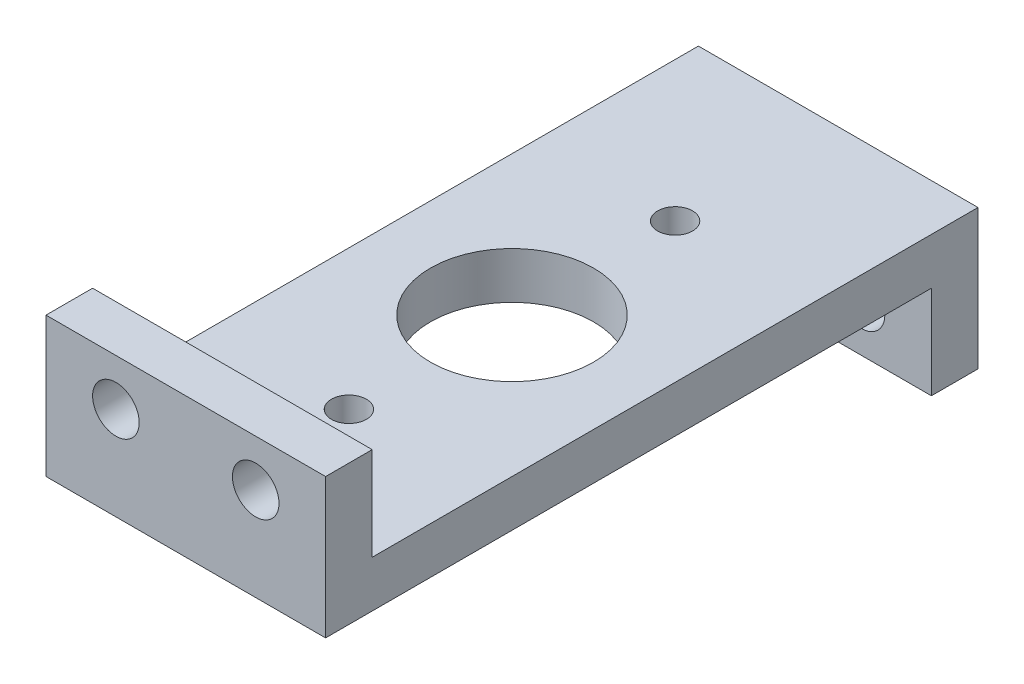
ISO-10303-21;
HEADER;
FILE_DESCRIPTION(('STEP AP214'),'2;1');
FILE_NAME('part.step','',(''),(''),'','','');
FILE_SCHEMA(('AUTOMOTIVE_DESIGN { 1 0 10303 214 1 1 1 1 }'));
ENDSEC;
DATA;
#1=APPLICATION_CONTEXT('core data for automotive mechanical design processes');
#2=APPLICATION_PROTOCOL_DEFINITION('international standard','automotive_design',2000,#1);
#3=PRODUCT_CONTEXT('',#1,'mechanical');
#4=PRODUCT('Part','Part','',(#3));
#5=PRODUCT_RELATED_PRODUCT_CATEGORY('part','',(#4));
#6=PRODUCT_DEFINITION_FORMATION('','',#4);
#7=PRODUCT_DEFINITION_CONTEXT('part definition',#1,'design');
#8=PRODUCT_DEFINITION('design','',#6,#7);
#9=PRODUCT_DEFINITION_SHAPE('','',#8);
#10=(LENGTH_UNIT() NAMED_UNIT(*) SI_UNIT(.MILLI.,.METRE.));
#11=(NAMED_UNIT(*) PLANE_ANGLE_UNIT() SI_UNIT($,.RADIAN.));
#12=(NAMED_UNIT(*) SI_UNIT($,.STERADIAN.) SOLID_ANGLE_UNIT());
#13=UNCERTAINTY_MEASURE_WITH_UNIT(LENGTH_MEASURE(1.E-05),#10,'distance_accuracy_value','');
#14=(GEOMETRIC_REPRESENTATION_CONTEXT(3) GLOBAL_UNCERTAINTY_ASSIGNED_CONTEXT((#13)) GLOBAL_UNIT_ASSIGNED_CONTEXT((#10,
#11,#12)) REPRESENTATION_CONTEXT('',''));
#15=CARTESIAN_POINT('',(0.,0.,0.));
#16=DIRECTION('',(0.,0.,1.));
#17=DIRECTION('',(1.,0.,0.));
#18=AXIS2_PLACEMENT_3D('',#15,#16,#17);
#19=CARTESIAN_POINT('',(76.2,-25.3345360824742,78.8185567010309));
#20=DIRECTION('',(0.,1.,0.));
#21=DIRECTION('',(0.,0.,1.));
#22=AXIS2_PLACEMENT_3D('',#19,#20,#21);
#23=PLANE('',#22);
#24=CARTESIAN_POINT('',(38.1,-25.3345360824742,34.3685567010309));
#25=DIRECTION('',(0.,1.,0.));
#26=DIRECTION('',(0.,0.,1.));
#27=AXIS2_PLACEMENT_3D('',#24,#25,#26);
#28=CIRCLE('',#27,4.7625);
#29=CARTESIAN_POINT('',(38.1,-25.3345360824742,39.1310567010309));
#30=VERTEX_POINT('',#29);
#31=EDGE_CURVE('E184',#30,#30,#28,.T.);
#32=ORIENTED_EDGE('',*,*,#31,.T.);
#33=EDGE_LOOP('',(#32));
#34=FACE_BOUND('',#33,.T.);
#35=CARTESIAN_POINT('',(38.1,-25.3345360824742,-54.5314432989691));
#36=DIRECTION('',(0.,1.,0.));
#37=DIRECTION('',(0.,0.,1.));
#38=AXIS2_PLACEMENT_3D('',#35,#36,#37);
#39=CIRCLE('',#38,4.7625);
#40=CARTESIAN_POINT('',(38.1,-25.3345360824742,-49.7689432989691));
#41=VERTEX_POINT('',#40);
#42=EDGE_CURVE('E284',#41,#41,#39,.T.);
#43=ORIENTED_EDGE('',*,*,#42,.T.);
#44=EDGE_LOOP('',(#43));
#45=FACE_BOUND('',#44,.T.);
#46=CARTESIAN_POINT('',(38.1,-25.3345360824742,-10.0814432989691));
#47=DIRECTION('',(0.,1.,0.));
#48=DIRECTION('',(0.,0.,1.));
#49=AXIS2_PLACEMENT_3D('',#46,#47,#48);
#50=CIRCLE('',#49,22.225);
#51=CARTESIAN_POINT('',(38.1,-25.3345360824742,12.1435567010309));
#52=VERTEX_POINT('',#51);
#53=EDGE_CURVE('E286',#52,#52,#50,.T.);
#54=ORIENTED_EDGE('',*,*,#53,.T.);
#55=EDGE_LOOP('',(#54));
#56=FACE_BOUND('',#55,.T.);
#57=DIRECTION('',(0.,0.,-1.));
#58=VECTOR('',#57,1.);
#59=CARTESIAN_POINT('',(0.,-25.3345360824742,78.8185567010309));
#60=LINE('',#59,#58);
#61=CARTESIAN_POINT('',(0.,-25.3345360824742,78.8185567010309));
#62=VERTEX_POINT('',#61);
#63=CARTESIAN_POINT('',(0.,-25.3345360824742,-86.281443298969));
#64=VERTEX_POINT('',#63);
#65=EDGE_CURVE('E146',#62,#64,#60,.T.);
#66=ORIENTED_EDGE('',*,*,#65,.T.);
#67=DIRECTION('',(-1.,0.,0.));
#68=VECTOR('',#67,1.);
#69=CARTESIAN_POINT('',(76.2,-25.3345360824742,-86.281443298969));
#70=LINE('',#69,#68);
#71=CARTESIAN_POINT('',(76.2,-25.3345360824742,-86.281443298969));
#72=VERTEX_POINT('',#71);
#73=EDGE_CURVE('E53',#72,#64,#70,.T.);
#74=ORIENTED_EDGE('',*,*,#73,.F.);
#75=DIRECTION('',(0.,0.,-1.));
#76=VECTOR('',#75,1.);
#77=CARTESIAN_POINT('',(76.2,-25.3345360824742,78.8185567010309));
#78=LINE('',#77,#76);
#79=CARTESIAN_POINT('',(76.2,-25.3345360824742,78.8185567010309));
#80=VERTEX_POINT('',#79);
#81=EDGE_CURVE('E106',#80,#72,#78,.T.);
#82=ORIENTED_EDGE('',*,*,#81,.F.);
#83=DIRECTION('',(-1.,0.,0.));
#84=VECTOR('',#83,1.);
#85=CARTESIAN_POINT('',(76.2,-25.3345360824742,78.8185567010309));
#86=LINE('',#85,#84);
#87=EDGE_CURVE('E13',#80,#62,#86,.T.);
#88=ORIENTED_EDGE('',*,*,#87,.T.);
#89=EDGE_LOOP('',(#66,#74,#82,#88));
#90=FACE_BOUND('',#89,.T.);
#91=ADVANCED_FACE('F44',(#34,#45,#56,#90),#23,.F.);
#92=CARTESIAN_POINT('',(76.2,-25.3345360824742,-86.281443298969));
#93=DIRECTION('',(0.,0.,-1.));
#94=DIRECTION('',(0.,1.,0.));
#95=AXIS2_PLACEMENT_3D('',#92,#93,#94);
#96=PLANE('',#95);
#97=CARTESIAN_POINT('',(57.15,-38.0345360824742,-86.281443298969));
#98=DIRECTION('',(0.,0.,-1.));
#99=DIRECTION('',(0.,1.,0.));
#100=AXIS2_PLACEMENT_3D('',#97,#98,#99);
#101=CIRCLE('',#100,6.35);
#102=CARTESIAN_POINT('',(57.15,-31.6845360824742,-86.281443298969));
#103=VERTEX_POINT('',#102);
#104=EDGE_CURVE('E149',#103,#103,#101,.T.);
#105=ORIENTED_EDGE('',*,*,#104,.T.);
#106=EDGE_LOOP('',(#105));
#107=FACE_BOUND('',#106,.T.);
#108=CARTESIAN_POINT('',(19.05,-38.0345360824742,-86.281443298969));
#109=DIRECTION('',(0.,0.,-1.));
#110=DIRECTION('',(0.,1.,0.));
#111=AXIS2_PLACEMENT_3D('',#108,#109,#110);
#112=CIRCLE('',#111,6.35);
#113=CARTESIAN_POINT('',(19.05,-31.6845360824742,-86.281443298969));
#114=VERTEX_POINT('',#113);
#115=EDGE_CURVE('E192',#114,#114,#112,.T.);
#116=ORIENTED_EDGE('',*,*,#115,.T.);
#117=EDGE_LOOP('',(#116));
#118=FACE_BOUND('',#117,.T.);
#119=DIRECTION('',(0.,-1.,0.));
#120=VECTOR('',#119,1.);
#121=CARTESIAN_POINT('',(0.,-25.3345360824742,-86.281443298969));
#122=LINE('',#121,#120);
#123=CARTESIAN_POINT('',(0.,-50.7345360824742,-86.2814432989691));
#124=VERTEX_POINT('',#123);
#125=EDGE_CURVE('E148',#64,#124,#122,.T.);
#126=ORIENTED_EDGE('',*,*,#125,.T.);
#127=DIRECTION('',(-1.,0.,0.));
#128=VECTOR('',#127,1.);
#129=CARTESIAN_POINT('',(76.2,-50.7345360824742,-86.2814432989691));
#130=LINE('',#129,#128);
#131=CARTESIAN_POINT('',(76.2,-50.7345360824742,-86.2814432989691));
#132=VERTEX_POINT('',#131);
#133=EDGE_CURVE('E167',#132,#124,#130,.T.);
#134=ORIENTED_EDGE('',*,*,#133,.F.);
#135=DIRECTION('',(0.,-1.,0.));
#136=VECTOR('',#135,1.);
#137=CARTESIAN_POINT('',(76.2,-25.3345360824742,-86.281443298969));
#138=LINE('',#137,#136);
#139=EDGE_CURVE('E201',#72,#132,#138,.T.);
#140=ORIENTED_EDGE('',*,*,#139,.F.);
#141=ORIENTED_EDGE('',*,*,#73,.T.);
#142=EDGE_LOOP('',(#126,#134,#140,#141));
#143=FACE_BOUND('',#142,.T.);
#144=ADVANCED_FACE('F221',(#107,#118,#143),#96,.F.);
#145=CARTESIAN_POINT('',(76.2,-50.7345360824742,-98.9814432989691));
#146=DIRECTION('',(0.,1.,0.));
#147=DIRECTION('',(0.,0.,1.));
#148=AXIS2_PLACEMENT_3D('',#145,#146,#147);
#149=PLANE('',#148);
#150=DIRECTION('',(0.,0.,-1.));
#151=VECTOR('',#150,1.);
#152=CARTESIAN_POINT('',(0.,-50.7345360824742,-98.9814432989691));
#153=LINE('',#152,#151);
#154=CARTESIAN_POINT('',(0.,-50.7345360824742,-98.9814432989691));
#155=VERTEX_POINT('',#154);
#156=EDGE_CURVE('E151',#124,#155,#153,.T.);
#157=ORIENTED_EDGE('',*,*,#156,.T.);
#158=DIRECTION('',(-1.,0.,0.));
#159=VECTOR('',#158,1.);
#160=CARTESIAN_POINT('',(76.2,-50.7345360824742,-98.9814432989691));
#161=LINE('',#160,#159);
#162=CARTESIAN_POINT('',(76.2,-50.7345360824742,-98.9814432989691));
#163=VERTEX_POINT('',#162);
#164=EDGE_CURVE('E164',#163,#155,#161,.T.);
#165=ORIENTED_EDGE('',*,*,#164,.F.);
#166=DIRECTION('',(0.,0.,-1.));
#167=VECTOR('',#166,1.);
#168=CARTESIAN_POINT('',(76.2,-50.7345360824742,-98.9814432989691));
#169=LINE('',#168,#167);
#170=EDGE_CURVE('E203',#132,#163,#169,.T.);
#171=ORIENTED_EDGE('',*,*,#170,.F.);
#172=ORIENTED_EDGE('',*,*,#133,.T.);
#173=EDGE_LOOP('',(#157,#165,#171,#172));
#174=FACE_BOUND('',#173,.T.);
#175=ADVANCED_FACE('F209',(#174),#149,.F.);
#176=CARTESIAN_POINT('',(76.2,-25.3345360824742,-98.9814432989691));
#177=DIRECTION('',(0.,0.,1.));
#178=DIRECTION('',(1.,0.,0.));
#179=AXIS2_PLACEMENT_3D('',#176,#177,#178);
#180=PLANE('',#179);
#181=CARTESIAN_POINT('',(57.15,-38.0345360824742,-98.9814432989691));
#182=DIRECTION('',(0.,0.,-1.));
#183=DIRECTION('',(0.,1.,0.));
#184=AXIS2_PLACEMENT_3D('',#181,#182,#183);
#185=CIRCLE('',#184,6.35);
#186=CARTESIAN_POINT('',(57.15,-31.6845360824742,-98.9814432989691));
#187=VERTEX_POINT('',#186);
#188=EDGE_CURVE('E189',#187,#187,#185,.T.);
#189=ORIENTED_EDGE('',*,*,#188,.F.);
#190=EDGE_LOOP('',(#189));
#191=FACE_BOUND('',#190,.T.);
#192=CARTESIAN_POINT('',(19.05,-38.0345360824742,-98.9814432989691));
#193=DIRECTION('',(0.,0.,-1.));
#194=DIRECTION('',(0.,1.,0.));
#195=AXIS2_PLACEMENT_3D('',#192,#193,#194);
#196=CIRCLE('',#195,6.35);
#197=CARTESIAN_POINT('',(19.05,-31.6845360824742,-98.9814432989691));
#198=VERTEX_POINT('',#197);
#199=EDGE_CURVE('E177',#198,#198,#196,.T.);
#200=ORIENTED_EDGE('',*,*,#199,.F.);
#201=EDGE_LOOP('',(#200));
#202=FACE_BOUND('',#201,.T.);
#203=DIRECTION('',(0.,1.,0.));
#204=VECTOR('',#203,1.);
#205=CARTESIAN_POINT('',(0.,-25.3345360824742,-98.9814432989691));
#206=LINE('',#205,#204);
#207=CARTESIAN_POINT('',(0.,-12.6345360824742,-98.9814432989691));
#208=VERTEX_POINT('',#207);
#209=EDGE_CURVE('E154',#155,#208,#206,.T.);
#210=ORIENTED_EDGE('',*,*,#209,.T.);
#211=DIRECTION('',(-1.,0.,0.));
#212=VECTOR('',#211,1.);
#213=CARTESIAN_POINT('',(76.2,-12.6345360824742,-98.9814432989691));
#214=LINE('',#213,#212);
#215=CARTESIAN_POINT('',(76.2,-12.6345360824742,-98.9814432989691));
#216=VERTEX_POINT('',#215);
#217=EDGE_CURVE('E135',#216,#208,#214,.T.);
#218=ORIENTED_EDGE('',*,*,#217,.F.);
#219=DIRECTION('',(0.,1.,0.));
#220=VECTOR('',#219,1.);
#221=CARTESIAN_POINT('',(76.2,-25.3345360824742,-98.9814432989691));
#222=LINE('',#221,#220);
#223=EDGE_CURVE('E126',#163,#216,#222,.T.);
#224=ORIENTED_EDGE('',*,*,#223,.F.);
#225=ORIENTED_EDGE('',*,*,#164,.T.);
#226=EDGE_LOOP('',(#210,#218,#224,#225));
#227=FACE_BOUND('',#226,.T.);
#228=ADVANCED_FACE('F212',(#191,#202,#227),#180,.F.);
#229=CARTESIAN_POINT('',(76.2,-12.6345360824742,66.1185567010309));
#230=DIRECTION('',(0.,-1.,0.));
#231=DIRECTION('',(0.,0.,-1.));
#232=AXIS2_PLACEMENT_3D('',#229,#230,#231);
#233=PLANE('',#232);
#234=CARTESIAN_POINT('',(38.1,-12.6345360824742,34.3685567010309));
#235=DIRECTION('',(0.,1.,0.));
#236=DIRECTION('',(0.,0.,1.));
#237=AXIS2_PLACEMENT_3D('',#234,#235,#236);
#238=CIRCLE('',#237,4.7625);
#239=CARTESIAN_POINT('',(38.1,-12.6345360824742,39.1310567010309));
#240=VERTEX_POINT('',#239);
#241=EDGE_CURVE('E294',#240,#240,#238,.T.);
#242=ORIENTED_EDGE('',*,*,#241,.F.);
#243=EDGE_LOOP('',(#242));
#244=FACE_BOUND('',#243,.T.);
#245=CARTESIAN_POINT('',(38.1,-12.6345360824742,-54.5314432989691));
#246=DIRECTION('',(0.,1.,0.));
#247=DIRECTION('',(0.,0.,1.));
#248=AXIS2_PLACEMENT_3D('',#245,#246,#247);
#249=CIRCLE('',#248,4.7625);
#250=CARTESIAN_POINT('',(38.1,-12.6345360824742,-49.7689432989691));
#251=VERTEX_POINT('',#250);
#252=EDGE_CURVE('E281',#251,#251,#249,.T.);
#253=ORIENTED_EDGE('',*,*,#252,.F.);
#254=EDGE_LOOP('',(#253));
#255=FACE_BOUND('',#254,.T.);
#256=CARTESIAN_POINT('',(38.1,-12.6345360824742,-10.0814432989691));
#257=DIRECTION('',(0.,1.,0.));
#258=DIRECTION('',(0.,0.,1.));
#259=AXIS2_PLACEMENT_3D('',#256,#257,#258);
#260=CIRCLE('',#259,22.225);
#261=CARTESIAN_POINT('',(38.1,-12.6345360824742,12.1435567010309));
#262=VERTEX_POINT('',#261);
#263=EDGE_CURVE('E289',#262,#262,#260,.T.);
#264=ORIENTED_EDGE('',*,*,#263,.F.);
#265=EDGE_LOOP('',(#264));
#266=FACE_BOUND('',#265,.T.);
#267=DIRECTION('',(0.,0.,1.));
#268=VECTOR('',#267,1.);
#269=CARTESIAN_POINT('',(0.,-12.6345360824742,66.1185567010309));
#270=LINE('',#269,#268);
#271=CARTESIAN_POINT('',(0.,-12.6345360824742,66.1185567010309));
#272=VERTEX_POINT('',#271);
#273=EDGE_CURVE('E134',#208,#272,#270,.T.);
#274=ORIENTED_EDGE('',*,*,#273,.T.);
#275=DIRECTION('',(-1.,0.,0.));
#276=VECTOR('',#275,1.);
#277=CARTESIAN_POINT('',(76.2,-12.6345360824742,66.1185567010309));
#278=LINE('',#277,#276);
#279=CARTESIAN_POINT('',(76.2,-12.6345360824742,66.1185567010309));
#280=VERTEX_POINT('',#279);
#281=EDGE_CURVE('E131',#280,#272,#278,.T.);
#282=ORIENTED_EDGE('',*,*,#281,.F.);
#283=DIRECTION('',(0.,0.,1.));
#284=VECTOR('',#283,1.);
#285=CARTESIAN_POINT('',(76.2,-12.6345360824742,66.1185567010309));
#286=LINE('',#285,#284);
#287=EDGE_CURVE('E120',#216,#280,#286,.T.);
#288=ORIENTED_EDGE('',*,*,#287,.F.);
#289=ORIENTED_EDGE('',*,*,#217,.T.);
#290=EDGE_LOOP('',(#274,#282,#288,#289));
#291=FACE_BOUND('',#290,.T.);
#292=ADVANCED_FACE('F132',(#244,#255,#266,#291),#233,.F.);
#293=CARTESIAN_POINT('',(76.2,-12.6345360824742,66.1185567010309));
#294=DIRECTION('',(0.,0.,1.));
#295=DIRECTION('',(1.,0.,0.));
#296=AXIS2_PLACEMENT_3D('',#293,#294,#295);
#297=PLANE('',#296);
#298=CARTESIAN_POINT('',(57.15,0.0654639175257932,66.1185567010309));
#299=DIRECTION('',(0.,0.,-1.));
#300=DIRECTION('',(-1.,0.,0.));
#301=AXIS2_PLACEMENT_3D('',#298,#299,#300);
#302=CIRCLE('',#301,6.35000000000001);
#303=CARTESIAN_POINT('',(50.8,0.0654639175257932,66.1185567010309));
#304=VERTEX_POINT('',#303);
#305=EDGE_CURVE('E173',#304,#304,#302,.T.);
#306=ORIENTED_EDGE('',*,*,#305,.F.);
#307=EDGE_LOOP('',(#306));
#308=FACE_BOUND('',#307,.T.);
#309=CARTESIAN_POINT('',(19.05,0.0654639175257932,66.1185567010309));
#310=DIRECTION('',(0.,0.,-1.));
#311=DIRECTION('',(-1.,0.,0.));
#312=AXIS2_PLACEMENT_3D('',#309,#310,#311);
#313=CIRCLE('',#312,6.35);
#314=CARTESIAN_POINT('',(12.7,0.0654639175257932,66.1185567010309));
#315=VERTEX_POINT('',#314);
#316=EDGE_CURVE('E179',#315,#315,#313,.T.);
#317=ORIENTED_EDGE('',*,*,#316,.F.);
#318=EDGE_LOOP('',(#317));
#319=FACE_BOUND('',#318,.T.);
#320=DIRECTION('',(0.,1.,0.));
#321=VECTOR('',#320,1.);
#322=CARTESIAN_POINT('',(0.,-12.6345360824742,66.1185567010309));
#323=LINE('',#322,#321);
#324=CARTESIAN_POINT('',(0.,12.7654639175258,66.1185567010309));
#325=VERTEX_POINT('',#324);
#326=EDGE_CURVE('E92',#272,#325,#323,.T.);
#327=ORIENTED_EDGE('',*,*,#326,.T.);
#328=DIRECTION('',(-1.,0.,0.));
#329=VECTOR('',#328,1.);
#330=CARTESIAN_POINT('',(76.2,12.7654639175258,66.1185567010309));
#331=LINE('',#330,#329);
#332=CARTESIAN_POINT('',(76.2,12.7654639175258,66.1185567010309));
#333=VERTEX_POINT('',#332);
#334=EDGE_CURVE('E136',#333,#325,#331,.T.);
#335=ORIENTED_EDGE('',*,*,#334,.F.);
#336=DIRECTION('',(0.,1.,0.));
#337=VECTOR('',#336,1.);
#338=CARTESIAN_POINT('',(76.2,-12.6345360824742,66.1185567010309));
#339=LINE('',#338,#337);
#340=EDGE_CURVE('E124',#280,#333,#339,.T.);
#341=ORIENTED_EDGE('',*,*,#340,.F.);
#342=ORIENTED_EDGE('',*,*,#281,.T.);
#343=EDGE_LOOP('',(#327,#335,#341,#342));
#344=FACE_BOUND('',#343,.T.);
#345=ADVANCED_FACE('F138',(#308,#319,#344),#297,.F.);
#346=CARTESIAN_POINT('',(76.2,12.7654639175258,78.8185567010309));
#347=DIRECTION('',(0.,-1.,0.));
#348=DIRECTION('',(0.,0.,-1.));
#349=AXIS2_PLACEMENT_3D('',#346,#347,#348);
#350=PLANE('',#349);
#351=DIRECTION('',(0.,0.,1.));
#352=VECTOR('',#351,1.);
#353=CARTESIAN_POINT('',(0.,12.7654639175258,78.8185567010309));
#354=LINE('',#353,#352);
#355=CARTESIAN_POINT('',(0.,12.7654639175258,78.8185567010309));
#356=VERTEX_POINT('',#355);
#357=EDGE_CURVE('E99',#325,#356,#354,.T.);
#358=ORIENTED_EDGE('',*,*,#357,.T.);
#359=DIRECTION('',(-1.,0.,0.));
#360=VECTOR('',#359,1.);
#361=CARTESIAN_POINT('',(76.2,12.7654639175258,78.8185567010309));
#362=LINE('',#361,#360);
#363=CARTESIAN_POINT('',(76.2,12.7654639175258,78.8185567010309));
#364=VERTEX_POINT('',#363);
#365=EDGE_CURVE('E142',#364,#356,#362,.T.);
#366=ORIENTED_EDGE('',*,*,#365,.F.);
#367=DIRECTION('',(0.,0.,1.));
#368=VECTOR('',#367,1.);
#369=CARTESIAN_POINT('',(76.2,12.7654639175258,78.8185567010309));
#370=LINE('',#369,#368);
#371=EDGE_CURVE('E140',#333,#364,#370,.T.);
#372=ORIENTED_EDGE('',*,*,#371,.F.);
#373=ORIENTED_EDGE('',*,*,#334,.T.);
#374=EDGE_LOOP('',(#358,#366,#372,#373));
#375=FACE_BOUND('',#374,.T.);
#376=ADVANCED_FACE('F219',(#375),#350,.F.);
#377=CARTESIAN_POINT('',(76.2,-6.87590094184465,78.8185567010309));
#378=DIRECTION('',(0.,0.,-1.));
#379=DIRECTION('',(-1.,0.,0.));
#380=AXIS2_PLACEMENT_3D('',#377,#378,#379);
#381=PLANE('',#380);
#382=CARTESIAN_POINT('',(57.15,0.0654639175257932,78.8185567010309));
#383=DIRECTION('',(0.,0.,-1.));
#384=DIRECTION('',(-1.,0.,0.));
#385=AXIS2_PLACEMENT_3D('',#382,#383,#384);
#386=CIRCLE('',#385,6.35000000000001);
#387=CARTESIAN_POINT('',(50.8,0.0654639175257932,78.8185567010309));
#388=VERTEX_POINT('',#387);
#389=EDGE_CURVE('E47',#388,#388,#386,.T.);
#390=ORIENTED_EDGE('',*,*,#389,.T.);
#391=EDGE_LOOP('',(#390));
#392=FACE_BOUND('',#391,.T.);
#393=CARTESIAN_POINT('',(19.05,0.0654639175257932,78.8185567010309));
#394=DIRECTION('',(0.,0.,-1.));
#395=DIRECTION('',(-1.,0.,0.));
#396=AXIS2_PLACEMENT_3D('',#393,#394,#395);
#397=CIRCLE('',#396,6.35);
#398=CARTESIAN_POINT('',(12.7,0.0654639175257932,78.8185567010309));
#399=VERTEX_POINT('',#398);
#400=EDGE_CURVE('E171',#399,#399,#397,.T.);
#401=ORIENTED_EDGE('',*,*,#400,.T.);
#402=EDGE_LOOP('',(#401));
#403=FACE_BOUND('',#402,.T.);
#404=DIRECTION('',(0.,-1.,0.));
#405=VECTOR('',#404,1.);
#406=CARTESIAN_POINT('',(0.,-6.87590094184465,78.8185567010309));
#407=LINE('',#406,#405);
#408=EDGE_CURVE('E159',#356,#62,#407,.T.);
#409=ORIENTED_EDGE('',*,*,#408,.T.);
#410=ORIENTED_EDGE('',*,*,#87,.F.);
#411=DIRECTION('',(0.,-1.,0.));
#412=VECTOR('',#411,1.);
#413=CARTESIAN_POINT('',(76.2,-25.3345360824742,78.8185567010309));
#414=LINE('',#413,#412);
#415=EDGE_CURVE('E62',#364,#80,#414,.T.);
#416=ORIENTED_EDGE('',*,*,#415,.F.);
#417=ORIENTED_EDGE('',*,*,#365,.T.);
#418=EDGE_LOOP('',(#409,#410,#416,#417));
#419=FACE_BOUND('',#418,.T.);
#420=ADVANCED_FACE('F218',(#392,#403,#419),#381,.F.);
#421=CARTESIAN_POINT('',(76.2,0.,0.));
#422=DIRECTION('',(-1.,0.,0.));
#423=DIRECTION('',(0.,0.,1.));
#424=AXIS2_PLACEMENT_3D('',#421,#422,#423);
#425=PLANE('',#424);
#426=ORIENTED_EDGE('',*,*,#415,.T.);
#427=ORIENTED_EDGE('',*,*,#81,.T.);
#428=ORIENTED_EDGE('',*,*,#139,.T.);
#429=ORIENTED_EDGE('',*,*,#170,.T.);
#430=ORIENTED_EDGE('',*,*,#223,.T.);
#431=ORIENTED_EDGE('',*,*,#287,.T.);
#432=ORIENTED_EDGE('',*,*,#340,.T.);
#433=ORIENTED_EDGE('',*,*,#371,.T.);
#434=EDGE_LOOP('',(#426,#427,#428,#429,#430,#431,#432,#433));
#435=FACE_BOUND('',#434,.T.);
#436=ADVANCED_FACE('F122',(#435),#425,.F.);
#437=CARTESIAN_POINT('',(0.,0.,0.));
#438=DIRECTION('',(-1.,0.,0.));
#439=DIRECTION('',(0.,0.,1.));
#440=AXIS2_PLACEMENT_3D('',#437,#438,#439);
#441=PLANE('',#440);
#442=ORIENTED_EDGE('',*,*,#65,.F.);
#443=ORIENTED_EDGE('',*,*,#408,.F.);
#444=ORIENTED_EDGE('',*,*,#357,.F.);
#445=ORIENTED_EDGE('',*,*,#326,.F.);
#446=ORIENTED_EDGE('',*,*,#273,.F.);
#447=ORIENTED_EDGE('',*,*,#209,.F.);
#448=ORIENTED_EDGE('',*,*,#156,.F.);
#449=ORIENTED_EDGE('',*,*,#125,.F.);
#450=EDGE_LOOP('',(#442,#443,#444,#445,#446,#447,#448,#449));
#451=FACE_BOUND('',#450,.T.);
#452=ADVANCED_FACE('F215',(#451),#441,.T.);
#453=CARTESIAN_POINT('',(19.05,-38.0345360824743,-22.7814432989691));
#454=DIRECTION('',(0.,0.,-1.));
#455=DIRECTION('',(0.,1.,0.));
#456=AXIS2_PLACEMENT_3D('',#453,#454,#455);
#457=CYLINDRICAL_SURFACE('',#456,6.35);
#458=ORIENTED_EDGE('',*,*,#199,.T.);
#459=EDGE_LOOP('',(#458));
#460=FACE_BOUND('',#459,.T.);
#461=ORIENTED_EDGE('',*,*,#115,.F.);
#462=EDGE_LOOP('',(#461));
#463=FACE_BOUND('',#462,.T.);
#464=ADVANCED_FACE('F248',(#460,#463),#457,.F.);
#465=CARTESIAN_POINT('',(57.15,-38.0345360824743,-22.7814432989691));
#466=DIRECTION('',(0.,0.,-1.));
#467=DIRECTION('',(0.,1.,0.));
#468=AXIS2_PLACEMENT_3D('',#465,#466,#467);
#469=CYLINDRICAL_SURFACE('',#468,6.35);
#470=ORIENTED_EDGE('',*,*,#188,.T.);
#471=EDGE_LOOP('',(#470));
#472=FACE_BOUND('',#471,.T.);
#473=ORIENTED_EDGE('',*,*,#104,.F.);
#474=EDGE_LOOP('',(#473));
#475=FACE_BOUND('',#474,.T.);
#476=ADVANCED_FACE('F253',(#472,#475),#469,.F.);
#477=CARTESIAN_POINT('',(19.05,0.0654639175257932,142.318556701031));
#478=DIRECTION('',(0.,0.,-1.));
#479=DIRECTION('',(-1.,0.,0.));
#480=AXIS2_PLACEMENT_3D('',#477,#478,#479);
#481=CYLINDRICAL_SURFACE('',#480,6.35);
#482=ORIENTED_EDGE('',*,*,#316,.T.);
#483=EDGE_LOOP('',(#482));
#484=FACE_BOUND('',#483,.T.);
#485=ORIENTED_EDGE('',*,*,#400,.F.);
#486=EDGE_LOOP('',(#485));
#487=FACE_BOUND('',#486,.T.);
#488=ADVANCED_FACE('F257',(#484,#487),#481,.F.);
#489=CARTESIAN_POINT('',(57.15,0.0654639175257932,142.318556701031));
#490=DIRECTION('',(0.,0.,-1.));
#491=DIRECTION('',(-1.,0.,0.));
#492=AXIS2_PLACEMENT_3D('',#489,#490,#491);
#493=CYLINDRICAL_SURFACE('',#492,6.35000000000001);
#494=ORIENTED_EDGE('',*,*,#305,.T.);
#495=EDGE_LOOP('',(#494));
#496=FACE_BOUND('',#495,.T.);
#497=ORIENTED_EDGE('',*,*,#389,.F.);
#498=EDGE_LOOP('',(#497));
#499=FACE_BOUND('',#498,.T.);
#500=ADVANCED_FACE('F261',(#496,#499),#493,.F.);
#501=CARTESIAN_POINT('',(38.1,-88.8345360824742,-10.0814432989691));
#502=DIRECTION('',(0.,1.,0.));
#503=DIRECTION('',(0.,0.,1.));
#504=AXIS2_PLACEMENT_3D('',#501,#502,#503);
#505=CYLINDRICAL_SURFACE('',#504,22.225);
#506=ORIENTED_EDGE('',*,*,#263,.T.);
#507=EDGE_LOOP('',(#506));
#508=FACE_BOUND('',#507,.T.);
#509=ORIENTED_EDGE('',*,*,#53,.F.);
#510=EDGE_LOOP('',(#509));
#511=FACE_BOUND('',#510,.T.);
#512=ADVANCED_FACE('F265',(#508,#511),#505,.F.);
#513=CARTESIAN_POINT('',(38.1,-88.8345360824742,-54.5314432989691));
#514=DIRECTION('',(0.,1.,0.));
#515=DIRECTION('',(0.,0.,1.));
#516=AXIS2_PLACEMENT_3D('',#513,#514,#515);
#517=CYLINDRICAL_SURFACE('',#516,4.7625);
#518=ORIENTED_EDGE('',*,*,#252,.T.);
#519=EDGE_LOOP('',(#518));
#520=FACE_BOUND('',#519,.T.);
#521=ORIENTED_EDGE('',*,*,#42,.F.);
#522=EDGE_LOOP('',(#521));
#523=FACE_BOUND('',#522,.T.);
#524=ADVANCED_FACE('F268',(#520,#523),#517,.F.);
#525=CARTESIAN_POINT('',(38.1,-88.8345360824742,34.3685567010309));
#526=DIRECTION('',(0.,1.,0.));
#527=DIRECTION('',(0.,0.,1.));
#528=AXIS2_PLACEMENT_3D('',#525,#526,#527);
#529=CYLINDRICAL_SURFACE('',#528,4.7625);
#530=ORIENTED_EDGE('',*,*,#241,.T.);
#531=EDGE_LOOP('',(#530));
#532=FACE_BOUND('',#531,.T.);
#533=ORIENTED_EDGE('',*,*,#31,.F.);
#534=EDGE_LOOP('',(#533));
#535=FACE_BOUND('',#534,.T.);
#536=ADVANCED_FACE('F270',(#532,#535),#529,.F.);
#537=CLOSED_SHELL('',(#91,#144,#175,#228,#292,#345,#376,#420,#436,#452,#464,#476,#488,#500,#512,
#524,#536));
#538=MANIFOLD_SOLID_BREP('B2',#537);
#539=ADVANCED_BREP_SHAPE_REPRESENTATION('',(#18,#538),#14);
#540=SHAPE_DEFINITION_REPRESENTATION(#9,#539);
ENDSEC;
END-ISO-10303-21;
